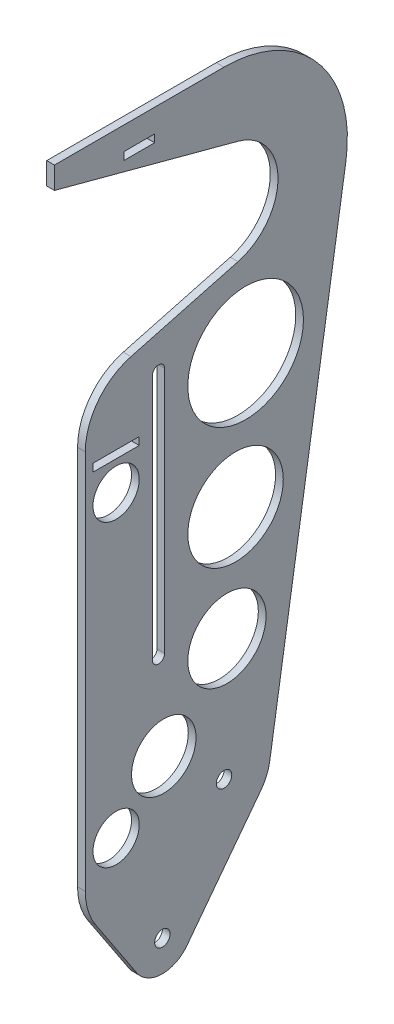
ISO-10303-21;
HEADER;
FILE_DESCRIPTION(('STEP AP214'),'2;1');
FILE_NAME('part.step','',(''),(''),'','','');
FILE_SCHEMA(('AUTOMOTIVE_DESIGN { 1 0 10303 214 1 1 1 1 }'));
ENDSEC;
DATA;
#1=APPLICATION_CONTEXT('core data for automotive mechanical design processes');
#2=APPLICATION_PROTOCOL_DEFINITION('international standard','automotive_design',2000,#1);
#3=PRODUCT_CONTEXT('',#1,'mechanical');
#4=PRODUCT('Part','Part','',(#3));
#5=PRODUCT_RELATED_PRODUCT_CATEGORY('part','',(#4));
#6=PRODUCT_DEFINITION_FORMATION('','',#4);
#7=PRODUCT_DEFINITION_CONTEXT('part definition',#1,'design');
#8=PRODUCT_DEFINITION('design','',#6,#7);
#9=PRODUCT_DEFINITION_SHAPE('','',#8);
#10=(LENGTH_UNIT() NAMED_UNIT(*) SI_UNIT(.MILLI.,.METRE.));
#11=(NAMED_UNIT(*) PLANE_ANGLE_UNIT() SI_UNIT($,.RADIAN.));
#12=(NAMED_UNIT(*) SI_UNIT($,.STERADIAN.) SOLID_ANGLE_UNIT());
#13=UNCERTAINTY_MEASURE_WITH_UNIT(LENGTH_MEASURE(1.E-05),#10,'distance_accuracy_value','');
#14=(GEOMETRIC_REPRESENTATION_CONTEXT(3) GLOBAL_UNCERTAINTY_ASSIGNED_CONTEXT((#13)) GLOBAL_UNIT_ASSIGNED_CONTEXT((#10,
#11,#12)) REPRESENTATION_CONTEXT('',''));
#15=CARTESIAN_POINT('',(0.,0.,0.));
#16=DIRECTION('',(0.,0.,1.));
#17=DIRECTION('',(1.,0.,0.));
#18=AXIS2_PLACEMENT_3D('',#15,#16,#17);
#19=CARTESIAN_POINT('',(3.175,203.2,0.));
#20=DIRECTION('',(-1.,0.,0.));
#21=DIRECTION('',(0.,0.,1.));
#22=AXIS2_PLACEMENT_3D('',#19,#20,#21);
#23=PLANE('',#22);
#24=CARTESIAN_POINT('',(3.175,124.46,44.45));
#25=DIRECTION('',(1.,0.,0.));
#26=DIRECTION('',(0.,0.,-1.));
#27=AXIS2_PLACEMENT_3D('',#24,#25,#26);
#28=CIRCLE('',#27,9.525);
#29=CARTESIAN_POINT('',(3.175,124.46,34.925));
#30=VERTEX_POINT('',#29);
#31=EDGE_CURVE('E855',#30,#30,#28,.T.);
#32=ORIENTED_EDGE('',*,*,#31,.F.);
#33=EDGE_LOOP('',(#32));
#34=FACE_BOUND('',#33,.T.);
#35=CARTESIAN_POINT('',(3.175,1.27,44.45));
#36=DIRECTION('',(1.,0.,0.));
#37=DIRECTION('',(0.,0.,-1.));
#38=AXIS2_PLACEMENT_3D('',#35,#36,#37);
#39=CIRCLE('',#38,9.525);
#40=CARTESIAN_POINT('',(3.175,1.27,34.925));
#41=VERTEX_POINT('',#40);
#42=EDGE_CURVE('E863',#41,#41,#39,.T.);
#43=ORIENTED_EDGE('',*,*,#42,.F.);
#44=EDGE_LOOP('',(#43));
#45=FACE_BOUND('',#44,.T.);
#46=CARTESIAN_POINT('',(3.175,147.612778574097,-8.88808208542456));
#47=DIRECTION('',(1.,0.,0.));
#48=DIRECTION('',(0.,0.,-1.));
#49=AXIS2_PLACEMENT_3D('',#46,#47,#48);
#50=CIRCLE('',#49,23.8105820854246);
#51=CARTESIAN_POINT('',(3.175,147.612778574097,-32.6986641708491));
#52=VERTEX_POINT('',#51);
#53=EDGE_CURVE('E870',#52,#52,#50,.T.);
#54=ORIENTED_EDGE('',*,*,#53,.F.);
#55=EDGE_LOOP('',(#54));
#56=FACE_BOUND('',#55,.T.);
#57=CARTESIAN_POINT('',(3.175,20.6984393575094,24.8267463531368));
#58=DIRECTION('',(1.,0.,0.));
#59=DIRECTION('',(0.,0.,-1.));
#60=AXIS2_PLACEMENT_3D('',#57,#58,#59);
#61=CIRCLE('',#60,13.2732536468632);
#62=CARTESIAN_POINT('',(3.175,20.6984393575094,11.5534927062736));
#63=VERTEX_POINT('',#62);
#64=EDGE_CURVE('E860',#63,#63,#61,.T.);
#65=ORIENTED_EDGE('',*,*,#64,.F.);
#66=EDGE_LOOP('',(#65));
#67=FACE_BOUND('',#66,.T.);
#68=CARTESIAN_POINT('',(3.175,49.6306110729896,-1.18592452574991));
#69=DIRECTION('',(1.,0.,0.));
#70=DIRECTION('',(0.,0.,-1.));
#71=AXIS2_PLACEMENT_3D('',#68,#69,#70);
#72=CIRCLE('',#71,16.1084245257499);
#73=CARTESIAN_POINT('',(3.175,49.6306110729896,-17.2943490514998));
#74=VERTEX_POINT('',#73);
#75=EDGE_CURVE('E254',#74,#74,#72,.T.);
#76=ORIENTED_EDGE('',*,*,#75,.F.);
#77=EDGE_LOOP('',(#76));
#78=FACE_BOUND('',#77,.T.);
#79=CARTESIAN_POINT('',(3.175,94.7824594358713,-4.73520965661337));
#80=DIRECTION('',(1.,0.,0.));
#81=DIRECTION('',(0.,0.,-1.));
#82=AXIS2_PLACEMENT_3D('',#79,#80,#81);
#83=CIRCLE('',#82,19.6577096566134);
#84=CARTESIAN_POINT('',(3.175,94.7824594358713,-24.3929193132267));
#85=VERTEX_POINT('',#84);
#86=EDGE_CURVE('E881',#85,#85,#83,.T.);
#87=ORIENTED_EDGE('',*,*,#86,.F.);
#88=EDGE_LOOP('',(#87));
#89=FACE_BOUND('',#88,.T.);
#90=DIRECTION('',(0.,0.,1.));
#91=VECTOR('',#90,1.);
#92=CARTESIAN_POINT('',(3.175,136.525,53.975));
#93=LINE('',#92,#91);
#94=CARTESIAN_POINT('',(3.175,136.525,34.925));
#95=VERTEX_POINT('',#94);
#96=CARTESIAN_POINT('',(3.175,136.525,53.975));
#97=VERTEX_POINT('',#96);
#98=EDGE_CURVE('E235',#95,#97,#93,.T.);
#99=ORIENTED_EDGE('',*,*,#98,.T.);
#100=DIRECTION('',(0.,1.,0.));
#101=VECTOR('',#100,1.);
#102=CARTESIAN_POINT('',(3.175,139.7,53.975));
#103=LINE('',#102,#101);
#104=CARTESIAN_POINT('',(3.175,139.7,53.975));
#105=VERTEX_POINT('',#104);
#106=EDGE_CURVE('E226',#97,#105,#103,.T.);
#107=ORIENTED_EDGE('',*,*,#106,.T.);
#108=DIRECTION('',(0.,0.,-1.));
#109=VECTOR('',#108,1.);
#110=CARTESIAN_POINT('',(3.175,139.7,53.975));
#111=LINE('',#110,#109);
#112=CARTESIAN_POINT('',(3.175,139.7,34.925));
#113=VERTEX_POINT('',#112);
#114=EDGE_CURVE('E238',#105,#113,#111,.T.);
#115=ORIENTED_EDGE('',*,*,#114,.T.);
#116=DIRECTION('',(0.,-1.,0.));
#117=VECTOR('',#116,1.);
#118=CARTESIAN_POINT('',(3.175,139.7,34.925));
#119=LINE('',#118,#117);
#120=EDGE_CURVE('E55',#113,#95,#119,.T.);
#121=ORIENTED_EDGE('',*,*,#120,.T.);
#122=EDGE_LOOP('',(#99,#107,#115,#121));
#123=FACE_BOUND('',#122,.T.);
#124=DIRECTION('',(0.,0.,1.));
#125=VECTOR('',#124,1.);
#126=CARTESIAN_POINT('',(3.175,241.3,41.275));
#127=LINE('',#126,#125);
#128=CARTESIAN_POINT('',(3.175,241.3,28.575));
#129=VERTEX_POINT('',#128);
#130=CARTESIAN_POINT('',(3.175,241.3,41.275));
#131=VERTEX_POINT('',#130);
#132=EDGE_CURVE('E286',#129,#131,#127,.T.);
#133=ORIENTED_EDGE('',*,*,#132,.T.);
#134=DIRECTION('',(0.,1.,0.));
#135=VECTOR('',#134,1.);
#136=CARTESIAN_POINT('',(3.175,241.3,41.275));
#137=LINE('',#136,#135);
#138=CARTESIAN_POINT('',(3.175,244.475,41.275));
#139=VERTEX_POINT('',#138);
#140=EDGE_CURVE('E278',#131,#139,#137,.T.);
#141=ORIENTED_EDGE('',*,*,#140,.T.);
#142=DIRECTION('',(0.,0.,-1.));
#143=VECTOR('',#142,1.);
#144=CARTESIAN_POINT('',(3.175,244.475,41.275));
#145=LINE('',#144,#143);
#146=CARTESIAN_POINT('',(3.175,244.475,28.575));
#147=VERTEX_POINT('',#146);
#148=EDGE_CURVE('E281',#139,#147,#145,.T.);
#149=ORIENTED_EDGE('',*,*,#148,.T.);
#150=DIRECTION('',(0.,-1.,0.));
#151=VECTOR('',#150,1.);
#152=CARTESIAN_POINT('',(3.175,241.3,28.575));
#153=LINE('',#152,#151);
#154=EDGE_CURVE('E63',#147,#129,#153,.T.);
#155=ORIENTED_EDGE('',*,*,#154,.T.);
#156=EDGE_LOOP('',(#133,#141,#149,#155));
#157=FACE_BOUND('',#156,.T.);
#158=CARTESIAN_POINT('',(3.175,-43.9940905122494,25.4000000000001));
#159=DIRECTION('',(1.,0.,0.));
#160=DIRECTION('',(0.,0.,-1.));
#161=AXIS2_PLACEMENT_3D('',#158,#159,#160);
#162=CIRCLE('',#161,3.175);
#163=CARTESIAN_POINT('',(3.175,-43.9940905122494,22.2250000000001));
#164=VERTEX_POINT('',#163);
#165=EDGE_CURVE('E341',#164,#164,#162,.T.);
#166=ORIENTED_EDGE('',*,*,#165,.F.);
#167=EDGE_LOOP('',(#166));
#168=FACE_BOUND('',#167,.T.);
#169=CARTESIAN_POINT('',(3.175,0.,0.));
#170=DIRECTION('',(1.,0.,0.));
#171=DIRECTION('',(0.,0.,-1.));
#172=AXIS2_PLACEMENT_3D('',#169,#170,#171);
#173=CIRCLE('',#172,3.175);
#174=CARTESIAN_POINT('',(3.175,0.,-3.175));
#175=VERTEX_POINT('',#174);
#176=EDGE_CURVE('E347',#175,#175,#173,.T.);
#177=ORIENTED_EDGE('',*,*,#176,.F.);
#178=EDGE_LOOP('',(#177));
#179=FACE_BOUND('',#178,.T.);
#180=DIRECTION('',(0.,-1.,0.));
#181=VECTOR('',#180,1.);
#182=CARTESIAN_POINT('',(3.175,244.925264200928,69.85));
#183=LINE('',#182,#181);
#184=CARTESIAN_POINT('',(3.175,254.,69.85));
#185=VERTEX_POINT('',#184);
#186=CARTESIAN_POINT('',(3.175,244.925264200928,69.85));
#187=VERTEX_POINT('',#186);
#188=EDGE_CURVE('E353',#185,#187,#183,.T.);
#189=ORIENTED_EDGE('',*,*,#188,.T.);
#190=DIRECTION('',(0.,-0.258819045102514,-0.96592582628907));
#191=VECTOR('',#190,1.);
#192=CARTESIAN_POINT('',(3.175,244.925264200928,69.85));
#193=LINE('',#192,#191);
#194=CARTESIAN_POINT('',(3.175,224.667701489275,-5.75225327740338));
#195=VERTEX_POINT('',#194);
#196=EDGE_CURVE('E356',#187,#195,#193,.T.);
#197=ORIENTED_EDGE('',*,*,#196,.T.);
#198=CARTESIAN_POINT('',(3.175,203.2,0.));
#199=DIRECTION('',(-1.,0.,0.));
#200=DIRECTION('',(0.,0.,1.));
#201=AXIS2_PLACEMENT_3D('',#198,#199,#200);
#202=CIRCLE('',#201,22.225);
#203=CARTESIAN_POINT('',(3.175,181.732298510725,-5.75225327740356));
#204=VERTEX_POINT('',#203);
#205=EDGE_CURVE('E359',#195,#204,#202,.T.);
#206=ORIENTED_EDGE('',*,*,#205,.T.);
#207=DIRECTION('',(0.,-0.258819045102522,0.965925826289068));
#208=VECTOR('',#207,1.);
#209=CARTESIAN_POINT('',(3.175,181.732298510725,-5.75225327740354));
#210=LINE('',#209,#208);
#211=CARTESIAN_POINT('',(3.175,169.922101036024,38.3240037456041));
#212=VERTEX_POINT('',#211);
#213=EDGE_CURVE('E361',#204,#212,#210,.T.);
#214=ORIENTED_EDGE('',*,*,#213,.T.);
#215=CARTESIAN_POINT('',(3.175,145.387585048282,31.75));
#216=DIRECTION('',(1.,0.,0.));
#217=DIRECTION('',(0.,0.,1.));
#218=AXIS2_PLACEMENT_3D('',#215,#216,#217);
#219=CIRCLE('',#218,25.4);
#220=CARTESIAN_POINT('',(3.175,145.387585048282,57.15));
#221=VERTEX_POINT('',#220);
#222=EDGE_CURVE('E364',#212,#221,#219,.T.);
#223=ORIENTED_EDGE('',*,*,#222,.T.);
#224=DIRECTION('',(0.,-1.,0.));
#225=VECTOR('',#224,1.);
#226=CARTESIAN_POINT('',(3.175,-11.4024649442902,57.15));
#227=LINE('',#226,#225);
#228=CARTESIAN_POINT('',(3.175,-11.4024649442902,57.15));
#229=VERTEX_POINT('',#228);
#230=EDGE_CURVE('E367',#221,#229,#227,.T.);
#231=ORIENTED_EDGE('',*,*,#230,.T.);
#232=CARTESIAN_POINT('',(3.175,-11.4024649442902,31.75));
#233=DIRECTION('',(1.,0.,0.));
#234=DIRECTION('',(0.,0.,1.));
#235=AXIS2_PLACEMENT_3D('',#232,#233,#234);
#236=CIRCLE('',#235,25.4);
#237=CARTESIAN_POINT('',(3.175,-25.4262558388826,52.9276601385693));
#238=VERTEX_POINT('',#237);
#239=EDGE_CURVE('E370',#229,#238,#236,.T.);
#240=ORIENTED_EDGE('',*,*,#239,.T.);
#241=DIRECTION('',(0.,-0.833766147187767,-0.552117751755608));
#242=VECTOR('',#241,1.);
#243=CARTESIAN_POINT('',(3.175,-51.0059859595457,35.9888300692847));
#244=LINE('',#243,#242);
#245=CARTESIAN_POINT('',(3.175,-51.0059859595457,35.9888300692847));
#246=VERTEX_POINT('',#245);
#247=EDGE_CURVE('E372',#238,#246,#244,.T.);
#248=ORIENTED_EDGE('',*,*,#247,.T.);
#249=CARTESIAN_POINT('',(3.175,-43.9940905122494,25.4000000000001));
#250=DIRECTION('',(1.,0.,0.));
#251=DIRECTION('',(0.,0.,1.));
#252=AXIS2_PLACEMENT_3D('',#249,#250,#251);
#253=CIRCLE('',#252,12.7);
#254=CARTESIAN_POINT('',(3.175,-51.6691011502298,15.2814916263865));
#255=VERTEX_POINT('',#254);
#256=EDGE_CURVE('E374',#246,#255,#253,.T.);
#257=ORIENTED_EDGE('',*,*,#256,.T.);
#258=DIRECTION('',(0.,0.796732942804219,-0.604331546297666));
#259=VECTOR('',#258,1.);
#260=CARTESIAN_POINT('',(3.175,-51.6691011502298,15.2814916263865));
#261=LINE('',#260,#259);
#262=CARTESIAN_POINT('',(3.175,-11.5125159569705,-15.1777625604204));
#263=VERTEX_POINT('',#262);
#264=EDGE_CURVE('E376',#255,#263,#261,.T.);
#265=ORIENTED_EDGE('',*,*,#264,.T.);
#266=CARTESIAN_POINT('',(3.175,0.,0.));
#267=DIRECTION('',(1.,0.,0.));
#268=DIRECTION('',(0.,0.,-1.));
#269=AXIS2_PLACEMENT_3D('',#266,#267,#268);
#270=CIRCLE('',#269,19.05);
#271=CARTESIAN_POINT('',(3.175,-2.9765625,-18.8160191242354));
#272=VERTEX_POINT('',#271);
#273=EDGE_CURVE('E378',#263,#272,#270,.T.);
#274=ORIENTED_EDGE('',*,*,#273,.T.);
#275=DIRECTION('',(0.,0.987717539329944,-0.15625));
#276=VECTOR('',#275,1.);
#277=CARTESIAN_POINT('',(3.175,-2.9765625,-18.8160191242354));
#278=LINE('',#277,#276);
#279=CARTESIAN_POINT('',(3.175,195.2625,-50.1760509979612));
#280=VERTEX_POINT('',#279);
#281=EDGE_CURVE('E380',#272,#280,#278,.T.);
#282=ORIENTED_EDGE('',*,*,#281,.T.);
#283=CARTESIAN_POINT('',(3.175,203.2,0.));
#284=DIRECTION('',(1.,0.,0.));
#285=DIRECTION('',(0.,0.,1.));
#286=AXIS2_PLACEMENT_3D('',#283,#284,#285);
#287=CIRCLE('',#286,50.8);
#288=CARTESIAN_POINT('',(3.175,254.,0.));
#289=VERTEX_POINT('',#288);
#290=EDGE_CURVE('E382',#280,#289,#287,.T.);
#291=ORIENTED_EDGE('',*,*,#290,.T.);
#292=DIRECTION('',(0.,0.,1.));
#293=VECTOR('',#292,1.);
#294=CARTESIAN_POINT('',(3.175,254.,69.85));
#295=LINE('',#294,#293);
#296=EDGE_CURVE('E384',#289,#185,#295,.T.);
#297=ORIENTED_EDGE('',*,*,#296,.T.);
#298=EDGE_LOOP('',(#189,#197,#206,#214,#223,#231,#240,#248,#257,#265,#274,#282,#291,#297));
#299=FACE_BOUND('',#298,.T.);
#300=CARTESIAN_POINT('',(3.175,158.75,26.9875));
#301=DIRECTION('',(1.,0.,0.));
#302=DIRECTION('',(0.,0.,-1.));
#303=AXIS2_PLACEMENT_3D('',#300,#301,#302);
#304=CIRCLE('',#303,2.54);
#305=CARTESIAN_POINT('',(3.175,158.75,24.4475));
#306=VERTEX_POINT('',#305);
#307=CARTESIAN_POINT('',(3.175,158.75,29.5275));
#308=VERTEX_POINT('',#307);
#309=EDGE_CURVE('E308',#306,#308,#304,.T.);
#310=ORIENTED_EDGE('',*,*,#309,.F.);
#311=DIRECTION('',(0.,1.,0.));
#312=VECTOR('',#311,1.);
#313=CARTESIAN_POINT('',(3.175,158.75,24.4475));
#314=LINE('',#313,#312);
#315=CARTESIAN_POINT('',(3.175,57.15,24.4475));
#316=VERTEX_POINT('',#315);
#317=EDGE_CURVE('E317',#316,#306,#314,.T.);
#318=ORIENTED_EDGE('',*,*,#317,.F.);
#319=CARTESIAN_POINT('',(3.175,57.15,26.9875));
#320=DIRECTION('',(1.,0.,0.));
#321=DIRECTION('',(0.,0.,-1.));
#322=AXIS2_PLACEMENT_3D('',#319,#320,#321);
#323=CIRCLE('',#322,2.54);
#324=CARTESIAN_POINT('',(3.175,57.15,29.5275));
#325=VERTEX_POINT('',#324);
#326=EDGE_CURVE('E314',#325,#316,#323,.T.);
#327=ORIENTED_EDGE('',*,*,#326,.F.);
#328=DIRECTION('',(0.,-1.,0.));
#329=VECTOR('',#328,1.);
#330=CARTESIAN_POINT('',(3.175,158.75,29.5275));
#331=LINE('',#330,#329);
#332=EDGE_CURVE('E310',#308,#325,#331,.T.);
#333=ORIENTED_EDGE('',*,*,#332,.F.);
#334=EDGE_LOOP('',(#310,#318,#327,#333));
#335=FACE_BOUND('',#334,.T.);
#336=ADVANCED_FACE('F37',(#34,#45,#56,#67,#78,#89,#123,#157,#168,#179,#299,#335),#23,.F.);
#337=CARTESIAN_POINT('',(0.,203.2,0.));
#338=DIRECTION('',(-1.,0.,0.));
#339=DIRECTION('',(0.,0.,1.));
#340=AXIS2_PLACEMENT_3D('',#337,#338,#339);
#341=PLANE('',#340);
#342=CARTESIAN_POINT('',(0.,124.46,44.45));
#343=DIRECTION('',(1.,0.,0.));
#344=DIRECTION('',(0.,0.,-1.));
#345=AXIS2_PLACEMENT_3D('',#342,#343,#344);
#346=CIRCLE('',#345,9.525);
#347=CARTESIAN_POINT('',(0.,124.46,34.925));
#348=VERTEX_POINT('',#347);
#349=EDGE_CURVE('E853',#348,#348,#346,.T.);
#350=ORIENTED_EDGE('',*,*,#349,.T.);
#351=EDGE_LOOP('',(#350));
#352=FACE_BOUND('',#351,.T.);
#353=CARTESIAN_POINT('',(0.,1.27,44.45));
#354=DIRECTION('',(1.,0.,0.));
#355=DIRECTION('',(0.,0.,-1.));
#356=AXIS2_PLACEMENT_3D('',#353,#354,#355);
#357=CIRCLE('',#356,9.525);
#358=CARTESIAN_POINT('',(0.,1.27,34.925));
#359=VERTEX_POINT('',#358);
#360=EDGE_CURVE('E857',#359,#359,#357,.T.);
#361=ORIENTED_EDGE('',*,*,#360,.T.);
#362=EDGE_LOOP('',(#361));
#363=FACE_BOUND('',#362,.T.);
#364=CARTESIAN_POINT('',(0.,147.612778574097,-8.88808208542456));
#365=DIRECTION('',(1.,0.,0.));
#366=DIRECTION('',(0.,0.,-1.));
#367=AXIS2_PLACEMENT_3D('',#364,#365,#366);
#368=CIRCLE('',#367,23.8105820854246);
#369=CARTESIAN_POINT('',(0.,147.612778574097,-32.6986641708491));
#370=VERTEX_POINT('',#369);
#371=EDGE_CURVE('E293',#370,#370,#368,.T.);
#372=ORIENTED_EDGE('',*,*,#371,.T.);
#373=EDGE_LOOP('',(#372));
#374=FACE_BOUND('',#373,.T.);
#375=CARTESIAN_POINT('',(0.,20.6984393575094,24.8267463531368));
#376=DIRECTION('',(1.,0.,0.));
#377=DIRECTION('',(0.,0.,-1.));
#378=AXIS2_PLACEMENT_3D('',#375,#376,#377);
#379=CIRCLE('',#378,13.2732536468632);
#380=CARTESIAN_POINT('',(0.,20.6984393575094,11.5534927062736));
#381=VERTEX_POINT('',#380);
#382=EDGE_CURVE('E874',#381,#381,#379,.T.);
#383=ORIENTED_EDGE('',*,*,#382,.T.);
#384=EDGE_LOOP('',(#383));
#385=FACE_BOUND('',#384,.T.);
#386=CARTESIAN_POINT('',(0.,49.6306110729896,-1.18592452574991));
#387=DIRECTION('',(1.,0.,0.));
#388=DIRECTION('',(0.,0.,-1.));
#389=AXIS2_PLACEMENT_3D('',#386,#387,#388);
#390=CIRCLE('',#389,16.1084245257499);
#391=CARTESIAN_POINT('',(0.,49.6306110729896,-17.2943490514998));
#392=VERTEX_POINT('',#391);
#393=EDGE_CURVE('E883',#392,#392,#390,.T.);
#394=ORIENTED_EDGE('',*,*,#393,.T.);
#395=EDGE_LOOP('',(#394));
#396=FACE_BOUND('',#395,.T.);
#397=CARTESIAN_POINT('',(0.,94.7824594358713,-4.73520965661337));
#398=DIRECTION('',(1.,0.,0.));
#399=DIRECTION('',(0.,0.,-1.));
#400=AXIS2_PLACEMENT_3D('',#397,#398,#399);
#401=CIRCLE('',#400,19.6577096566134);
#402=CARTESIAN_POINT('',(0.,94.7824594358713,-24.3929193132267));
#403=VERTEX_POINT('',#402);
#404=EDGE_CURVE('E873',#403,#403,#401,.T.);
#405=ORIENTED_EDGE('',*,*,#404,.T.);
#406=EDGE_LOOP('',(#405));
#407=FACE_BOUND('',#406,.T.);
#408=DIRECTION('',(0.,1.,0.));
#409=VECTOR('',#408,1.);
#410=CARTESIAN_POINT('',(0.,139.7,53.975));
#411=LINE('',#410,#409);
#412=CARTESIAN_POINT('',(0.,136.525,53.975));
#413=VERTEX_POINT('',#412);
#414=CARTESIAN_POINT('',(0.,139.7,53.975));
#415=VERTEX_POINT('',#414);
#416=EDGE_CURVE('E229',#413,#415,#411,.T.);
#417=ORIENTED_EDGE('',*,*,#416,.F.);
#418=DIRECTION('',(0.,0.,1.));
#419=VECTOR('',#418,1.);
#420=CARTESIAN_POINT('',(0.,136.525,53.975));
#421=LINE('',#420,#419);
#422=CARTESIAN_POINT('',(0.,136.525,34.925));
#423=VERTEX_POINT('',#422);
#424=EDGE_CURVE('E246',#423,#413,#421,.T.);
#425=ORIENTED_EDGE('',*,*,#424,.F.);
#426=DIRECTION('',(0.,-1.,0.));
#427=VECTOR('',#426,1.);
#428=CARTESIAN_POINT('',(0.,139.7,34.925));
#429=LINE('',#428,#427);
#430=CARTESIAN_POINT('',(0.,139.7,34.925));
#431=VERTEX_POINT('',#430);
#432=EDGE_CURVE('E251',#431,#423,#429,.T.);
#433=ORIENTED_EDGE('',*,*,#432,.F.);
#434=DIRECTION('',(0.,0.,-1.));
#435=VECTOR('',#434,1.);
#436=CARTESIAN_POINT('',(0.,139.7,53.975));
#437=LINE('',#436,#435);
#438=EDGE_CURVE('E262',#415,#431,#437,.T.);
#439=ORIENTED_EDGE('',*,*,#438,.F.);
#440=EDGE_LOOP('',(#417,#425,#433,#439));
#441=FACE_BOUND('',#440,.T.);
#442=DIRECTION('',(0.,1.,0.));
#443=VECTOR('',#442,1.);
#444=CARTESIAN_POINT('',(0.,241.3,41.275));
#445=LINE('',#444,#443);
#446=CARTESIAN_POINT('',(0.,241.3,41.275));
#447=VERTEX_POINT('',#446);
#448=CARTESIAN_POINT('',(0.,244.475,41.275));
#449=VERTEX_POINT('',#448);
#450=EDGE_CURVE('E290',#447,#449,#445,.T.);
#451=ORIENTED_EDGE('',*,*,#450,.F.);
#452=DIRECTION('',(0.,0.,1.));
#453=VECTOR('',#452,1.);
#454=CARTESIAN_POINT('',(0.,241.3,41.275));
#455=LINE('',#454,#453);
#456=CARTESIAN_POINT('',(0.,241.3,28.575));
#457=VERTEX_POINT('',#456);
#458=EDGE_CURVE('E282',#457,#447,#455,.T.);
#459=ORIENTED_EDGE('',*,*,#458,.F.);
#460=DIRECTION('',(0.,-1.,0.));
#461=VECTOR('',#460,1.);
#462=CARTESIAN_POINT('',(0.,241.3,28.575));
#463=LINE('',#462,#461);
#464=CARTESIAN_POINT('',(0.,244.475,28.575));
#465=VERTEX_POINT('',#464);
#466=EDGE_CURVE('E296',#465,#457,#463,.T.);
#467=ORIENTED_EDGE('',*,*,#466,.F.);
#468=DIRECTION('',(0.,0.,-1.));
#469=VECTOR('',#468,1.);
#470=CARTESIAN_POINT('',(0.,244.475,41.275));
#471=LINE('',#470,#469);
#472=EDGE_CURVE('E292',#449,#465,#471,.T.);
#473=ORIENTED_EDGE('',*,*,#472,.F.);
#474=EDGE_LOOP('',(#451,#459,#467,#473));
#475=FACE_BOUND('',#474,.T.);
#476=CARTESIAN_POINT('',(0.,0.,0.));
#477=DIRECTION('',(1.,0.,0.));
#478=DIRECTION('',(0.,0.,-1.));
#479=AXIS2_PLACEMENT_3D('',#476,#477,#478);
#480=CIRCLE('',#479,3.175);
#481=CARTESIAN_POINT('',(0.,0.,-3.175));
#482=VERTEX_POINT('',#481);
#483=EDGE_CURVE('E344',#482,#482,#480,.T.);
#484=ORIENTED_EDGE('',*,*,#483,.T.);
#485=EDGE_LOOP('',(#484));
#486=FACE_BOUND('',#485,.T.);
#487=DIRECTION('',(0.,-1.,0.));
#488=VECTOR('',#487,1.);
#489=CARTESIAN_POINT('',(0.,244.925264200928,69.85));
#490=LINE('',#489,#488);
#491=CARTESIAN_POINT('',(0.,254.,69.85));
#492=VERTEX_POINT('',#491);
#493=CARTESIAN_POINT('',(0.,244.925264200928,69.85));
#494=VERTEX_POINT('',#493);
#495=EDGE_CURVE('E350',#492,#494,#490,.T.);
#496=ORIENTED_EDGE('',*,*,#495,.F.);
#497=DIRECTION('',(0.,0.,1.));
#498=VECTOR('',#497,1.);
#499=CARTESIAN_POINT('',(0.,254.,69.85));
#500=LINE('',#499,#498);
#501=CARTESIAN_POINT('',(0.,254.,0.));
#502=VERTEX_POINT('',#501);
#503=EDGE_CURVE('E357',#502,#492,#500,.T.);
#504=ORIENTED_EDGE('',*,*,#503,.F.);
#505=CARTESIAN_POINT('',(0.,203.2,0.));
#506=DIRECTION('',(1.,0.,0.));
#507=DIRECTION('',(0.,0.,1.));
#508=AXIS2_PLACEMENT_3D('',#505,#506,#507);
#509=CIRCLE('',#508,50.8);
#510=CARTESIAN_POINT('',(0.,195.2625,-50.1760509979612));
#511=VERTEX_POINT('',#510);
#512=EDGE_CURVE('E414',#511,#502,#509,.T.);
#513=ORIENTED_EDGE('',*,*,#512,.F.);
#514=DIRECTION('',(0.,0.987717539329944,-0.15625));
#515=VECTOR('',#514,1.);
#516=CARTESIAN_POINT('',(0.,-2.9765625,-18.8160191242354));
#517=LINE('',#516,#515);
#518=CARTESIAN_POINT('',(0.,-2.9765625,-18.8160191242354));
#519=VERTEX_POINT('',#518);
#520=EDGE_CURVE('E412',#519,#511,#517,.T.);
#521=ORIENTED_EDGE('',*,*,#520,.F.);
#522=CARTESIAN_POINT('',(0.,0.,0.));
#523=DIRECTION('',(1.,0.,0.));
#524=DIRECTION('',(0.,0.,-1.));
#525=AXIS2_PLACEMENT_3D('',#522,#523,#524);
#526=CIRCLE('',#525,19.05);
#527=CARTESIAN_POINT('',(0.,-11.5125159569705,-15.1777625604204));
#528=VERTEX_POINT('',#527);
#529=EDGE_CURVE('E410',#528,#519,#526,.T.);
#530=ORIENTED_EDGE('',*,*,#529,.F.);
#531=DIRECTION('',(0.,0.796732942804219,-0.604331546297666));
#532=VECTOR('',#531,1.);
#533=CARTESIAN_POINT('',(0.,-51.6691011502298,15.2814916263865));
#534=LINE('',#533,#532);
#535=CARTESIAN_POINT('',(0.,-51.6691011502298,15.2814916263865));
#536=VERTEX_POINT('',#535);
#537=EDGE_CURVE('E408',#536,#528,#534,.T.);
#538=ORIENTED_EDGE('',*,*,#537,.F.);
#539=CARTESIAN_POINT('',(0.,-43.9940905122494,25.4000000000001));
#540=DIRECTION('',(1.,0.,0.));
#541=DIRECTION('',(0.,0.,1.));
#542=AXIS2_PLACEMENT_3D('',#539,#540,#541);
#543=CIRCLE('',#542,12.7);
#544=CARTESIAN_POINT('',(0.,-51.0059859595457,35.9888300692847));
#545=VERTEX_POINT('',#544);
#546=EDGE_CURVE('E406',#545,#536,#543,.T.);
#547=ORIENTED_EDGE('',*,*,#546,.F.);
#548=DIRECTION('',(0.,-0.833766147187767,-0.552117751755608));
#549=VECTOR('',#548,1.);
#550=CARTESIAN_POINT('',(0.,-51.0059859595457,35.9888300692847));
#551=LINE('',#550,#549);
#552=CARTESIAN_POINT('',(0.,-25.4262558388826,52.9276601385693));
#553=VERTEX_POINT('',#552);
#554=EDGE_CURVE('E404',#553,#545,#551,.T.);
#555=ORIENTED_EDGE('',*,*,#554,.F.);
#556=CARTESIAN_POINT('',(0.,-11.4024649442902,31.75));
#557=DIRECTION('',(1.,0.,0.));
#558=DIRECTION('',(0.,0.,1.));
#559=AXIS2_PLACEMENT_3D('',#556,#557,#558);
#560=CIRCLE('',#559,25.4);
#561=CARTESIAN_POINT('',(0.,-11.4024649442902,57.15));
#562=VERTEX_POINT('',#561);
#563=EDGE_CURVE('E402',#562,#553,#560,.T.);
#564=ORIENTED_EDGE('',*,*,#563,.F.);
#565=DIRECTION('',(0.,-1.,0.));
#566=VECTOR('',#565,1.);
#567=CARTESIAN_POINT('',(0.,-11.4024649442902,57.15));
#568=LINE('',#567,#566);
#569=CARTESIAN_POINT('',(0.,145.387585048282,57.15));
#570=VERTEX_POINT('',#569);
#571=EDGE_CURVE('E399',#570,#562,#568,.T.);
#572=ORIENTED_EDGE('',*,*,#571,.F.);
#573=CARTESIAN_POINT('',(0.,145.387585048282,31.75));
#574=DIRECTION('',(1.,0.,0.));
#575=DIRECTION('',(0.,0.,1.));
#576=AXIS2_PLACEMENT_3D('',#573,#574,#575);
#577=CIRCLE('',#576,25.4);
#578=CARTESIAN_POINT('',(0.,169.922101036024,38.3240037456041));
#579=VERTEX_POINT('',#578);
#580=EDGE_CURVE('E396',#579,#570,#577,.T.);
#581=ORIENTED_EDGE('',*,*,#580,.F.);
#582=DIRECTION('',(0.,-0.258819045102522,0.965925826289068));
#583=VECTOR('',#582,1.);
#584=CARTESIAN_POINT('',(0.,181.732298510725,-5.75225327740354));
#585=LINE('',#584,#583);
#586=CARTESIAN_POINT('',(0.,181.732298510725,-5.75225327740356));
#587=VERTEX_POINT('',#586);
#588=EDGE_CURVE('E393',#587,#579,#585,.T.);
#589=ORIENTED_EDGE('',*,*,#588,.F.);
#590=CARTESIAN_POINT('',(0.,203.2,0.));
#591=DIRECTION('',(-1.,0.,0.));
#592=DIRECTION('',(0.,0.,1.));
#593=AXIS2_PLACEMENT_3D('',#590,#591,#592);
#594=CIRCLE('',#593,22.225);
#595=CARTESIAN_POINT('',(0.,224.667701489275,-5.75225327740338));
#596=VERTEX_POINT('',#595);
#597=EDGE_CURVE('E391',#596,#587,#594,.T.);
#598=ORIENTED_EDGE('',*,*,#597,.F.);
#599=DIRECTION('',(0.,-0.258819045102514,-0.96592582628907));
#600=VECTOR('',#599,1.);
#601=CARTESIAN_POINT('',(0.,244.925264200928,69.85));
#602=LINE('',#601,#600);
#603=EDGE_CURVE('E389',#494,#596,#602,.T.);
#604=ORIENTED_EDGE('',*,*,#603,.F.);
#605=EDGE_LOOP('',(#496,#504,#513,#521,#530,#538,#547,#555,#564,#572,#581,#589,#598,#604));
#606=FACE_BOUND('',#605,.T.);
#607=CARTESIAN_POINT('',(0.,-43.9940905122494,25.4000000000001));
#608=DIRECTION('',(1.,0.,0.));
#609=DIRECTION('',(0.,0.,-1.));
#610=AXIS2_PLACEMENT_3D('',#607,#608,#609);
#611=CIRCLE('',#610,3.175);
#612=CARTESIAN_POINT('',(0.,-43.9940905122494,22.2250000000001));
#613=VERTEX_POINT('',#612);
#614=EDGE_CURVE('E340',#613,#613,#611,.T.);
#615=ORIENTED_EDGE('',*,*,#614,.T.);
#616=EDGE_LOOP('',(#615));
#617=FACE_BOUND('',#616,.T.);
#618=DIRECTION('',(0.,1.,0.));
#619=VECTOR('',#618,1.);
#620=CARTESIAN_POINT('',(0.,158.75,24.4475));
#621=LINE('',#620,#619);
#622=CARTESIAN_POINT('',(0.,57.15,24.4475));
#623=VERTEX_POINT('',#622);
#624=CARTESIAN_POINT('',(0.,158.75,24.4475));
#625=VERTEX_POINT('',#624);
#626=EDGE_CURVE('E311',#623,#625,#621,.T.);
#627=ORIENTED_EDGE('',*,*,#626,.T.);
#628=CARTESIAN_POINT('',(0.,158.75,26.9875));
#629=DIRECTION('',(1.,0.,0.));
#630=DIRECTION('',(0.,0.,-1.));
#631=AXIS2_PLACEMENT_3D('',#628,#629,#630);
#632=CIRCLE('',#631,2.54);
#633=CARTESIAN_POINT('',(0.,158.75,29.5275));
#634=VERTEX_POINT('',#633);
#635=EDGE_CURVE('E272',#625,#634,#632,.T.);
#636=ORIENTED_EDGE('',*,*,#635,.T.);
#637=DIRECTION('',(0.,-1.,0.));
#638=VECTOR('',#637,1.);
#639=CARTESIAN_POINT('',(0.,158.75,29.5275));
#640=LINE('',#639,#638);
#641=CARTESIAN_POINT('',(0.,57.15,29.5275));
#642=VERTEX_POINT('',#641);
#643=EDGE_CURVE('E322',#634,#642,#640,.T.);
#644=ORIENTED_EDGE('',*,*,#643,.T.);
#645=CARTESIAN_POINT('',(0.,57.15,26.9875));
#646=DIRECTION('',(1.,0.,0.));
#647=DIRECTION('',(0.,0.,-1.));
#648=AXIS2_PLACEMENT_3D('',#645,#646,#647);
#649=CIRCLE('',#648,2.54);
#650=EDGE_CURVE('E326',#642,#623,#649,.T.);
#651=ORIENTED_EDGE('',*,*,#650,.T.);
#652=EDGE_LOOP('',(#627,#636,#644,#651));
#653=FACE_BOUND('',#652,.T.);
#654=ADVANCED_FACE('F464',(#352,#363,#374,#385,#396,#407,#441,#475,#486,#606,#617,#653),#341,.T.);
#655=CARTESIAN_POINT('',(3.175,244.925264200928,69.85));
#656=DIRECTION('',(0.,0.,-1.));
#657=DIRECTION('',(-1.,0.,0.));
#658=AXIS2_PLACEMENT_3D('',#655,#656,#657);
#659=PLANE('',#658);
#660=ORIENTED_EDGE('',*,*,#495,.T.);
#661=DIRECTION('',(-1.,0.,0.));
#662=VECTOR('',#661,1.);
#663=CARTESIAN_POINT('',(3.175,244.925264200928,69.85));
#664=LINE('',#663,#662);
#665=EDGE_CURVE('E11',#187,#494,#664,.T.);
#666=ORIENTED_EDGE('',*,*,#665,.F.);
#667=ORIENTED_EDGE('',*,*,#188,.F.);
#668=DIRECTION('',(-1.,0.,0.));
#669=VECTOR('',#668,1.);
#670=CARTESIAN_POINT('',(3.175,254.,69.85));
#671=LINE('',#670,#669);
#672=EDGE_CURVE('E386',#185,#492,#671,.T.);
#673=ORIENTED_EDGE('',*,*,#672,.T.);
#674=EDGE_LOOP('',(#660,#666,#667,#673));
#675=FACE_BOUND('',#674,.T.);
#676=ADVANCED_FACE('F39',(#675),#659,.F.);
#677=CARTESIAN_POINT('',(3.175,244.925264200928,69.85));
#678=DIRECTION('',(0.,0.96592582628907,-0.258819045102514));
#679=DIRECTION('',(0.,0.258819045102514,0.96592582628907));
#680=AXIS2_PLACEMENT_3D('',#677,#678,#679);
#681=PLANE('',#680);
#682=ORIENTED_EDGE('',*,*,#603,.T.);
#683=DIRECTION('',(-1.,0.,0.));
#684=VECTOR('',#683,1.);
#685=CARTESIAN_POINT('',(3.175,224.667701489275,-5.75225327740338));
#686=LINE('',#685,#684);
#687=EDGE_CURVE('E45',#195,#596,#686,.T.);
#688=ORIENTED_EDGE('',*,*,#687,.F.);
#689=ORIENTED_EDGE('',*,*,#196,.F.);
#690=ORIENTED_EDGE('',*,*,#665,.T.);
#691=EDGE_LOOP('',(#682,#688,#689,#690));
#692=FACE_BOUND('',#691,.T.);
#693=ADVANCED_FACE('F482',(#692),#681,.F.);
#694=CARTESIAN_POINT('',(3.175,203.2,0.));
#695=DIRECTION('',(-1.,0.,0.));
#696=DIRECTION('',(0.,0.,1.));
#697=AXIS2_PLACEMENT_3D('',#694,#695,#696);
#698=CYLINDRICAL_SURFACE('',#697,22.225);
#699=ORIENTED_EDGE('',*,*,#597,.T.);
#700=DIRECTION('',(-1.,0.,0.));
#701=VECTOR('',#700,1.);
#702=CARTESIAN_POINT('',(3.175,181.732298510725,-5.75225327740356));
#703=LINE('',#702,#701);
#704=EDGE_CURVE('E451',#204,#587,#703,.T.);
#705=ORIENTED_EDGE('',*,*,#704,.F.);
#706=ORIENTED_EDGE('',*,*,#205,.F.);
#707=ORIENTED_EDGE('',*,*,#687,.T.);
#708=EDGE_LOOP('',(#699,#705,#706,#707));
#709=FACE_BOUND('',#708,.T.);
#710=ADVANCED_FACE('F458',(#709),#698,.F.);
#711=CARTESIAN_POINT('',(3.175,181.732298510725,-5.75225327740354));
#712=DIRECTION('',(0.,-0.965925826289068,-0.258819045102522));
#713=DIRECTION('',(0.,0.258819045102522,-0.965925826289068));
#714=AXIS2_PLACEMENT_3D('',#711,#712,#713);
#715=PLANE('',#714);
#716=ORIENTED_EDGE('',*,*,#588,.T.);
#717=DIRECTION('',(-1.,0.,0.));
#718=VECTOR('',#717,1.);
#719=CARTESIAN_POINT('',(3.175,169.922101036024,38.3240037456041));
#720=LINE('',#719,#718);
#721=EDGE_CURVE('E447',#212,#579,#720,.T.);
#722=ORIENTED_EDGE('',*,*,#721,.F.);
#723=ORIENTED_EDGE('',*,*,#213,.F.);
#724=ORIENTED_EDGE('',*,*,#704,.T.);
#725=EDGE_LOOP('',(#716,#722,#723,#724));
#726=FACE_BOUND('',#725,.T.);
#727=ADVANCED_FACE('F470',(#726),#715,.F.);
#728=CARTESIAN_POINT('',(3.175,145.387585048282,31.75));
#729=DIRECTION('',(-1.,0.,0.));
#730=DIRECTION('',(0.,0.,1.));
#731=AXIS2_PLACEMENT_3D('',#728,#729,#730);
#732=CYLINDRICAL_SURFACE('',#731,25.4);
#733=ORIENTED_EDGE('',*,*,#580,.T.);
#734=DIRECTION('',(-1.,0.,0.));
#735=VECTOR('',#734,1.);
#736=CARTESIAN_POINT('',(3.175,145.387585048282,57.15));
#737=LINE('',#736,#735);
#738=EDGE_CURVE('E443',#221,#570,#737,.T.);
#739=ORIENTED_EDGE('',*,*,#738,.F.);
#740=ORIENTED_EDGE('',*,*,#222,.F.);
#741=ORIENTED_EDGE('',*,*,#721,.T.);
#742=EDGE_LOOP('',(#733,#739,#740,#741));
#743=FACE_BOUND('',#742,.T.);
#744=ADVANCED_FACE('F474',(#743),#732,.T.);
#745=CARTESIAN_POINT('',(3.175,-11.4024649442902,57.15));
#746=DIRECTION('',(0.,0.,-1.));
#747=DIRECTION('',(0.,1.,0.));
#748=AXIS2_PLACEMENT_3D('',#745,#746,#747);
#749=PLANE('',#748);
#750=ORIENTED_EDGE('',*,*,#571,.T.);
#751=DIRECTION('',(-1.,0.,0.));
#752=VECTOR('',#751,1.);
#753=CARTESIAN_POINT('',(3.175,-11.4024649442902,57.15));
#754=LINE('',#753,#752);
#755=EDGE_CURVE('E440',#229,#562,#754,.T.);
#756=ORIENTED_EDGE('',*,*,#755,.F.);
#757=ORIENTED_EDGE('',*,*,#230,.F.);
#758=ORIENTED_EDGE('',*,*,#738,.T.);
#759=EDGE_LOOP('',(#750,#756,#757,#758));
#760=FACE_BOUND('',#759,.T.);
#761=ADVANCED_FACE('F525',(#760),#749,.F.);
#762=CARTESIAN_POINT('',(3.175,-11.4024649442902,31.75));
#763=DIRECTION('',(-1.,0.,0.));
#764=DIRECTION('',(0.,0.,1.));
#765=AXIS2_PLACEMENT_3D('',#762,#763,#764);
#766=CYLINDRICAL_SURFACE('',#765,25.4);
#767=ORIENTED_EDGE('',*,*,#563,.T.);
#768=DIRECTION('',(-1.,0.,0.));
#769=VECTOR('',#768,1.);
#770=CARTESIAN_POINT('',(3.175,-25.4262558388826,52.9276601385693));
#771=LINE('',#770,#769);
#772=EDGE_CURVE('E437',#238,#553,#771,.T.);
#773=ORIENTED_EDGE('',*,*,#772,.F.);
#774=ORIENTED_EDGE('',*,*,#239,.F.);
#775=ORIENTED_EDGE('',*,*,#755,.T.);
#776=EDGE_LOOP('',(#767,#773,#774,#775));
#777=FACE_BOUND('',#776,.T.);
#778=ADVANCED_FACE('F523',(#777),#766,.T.);
#779=CARTESIAN_POINT('',(3.175,-51.0059859595457,35.9888300692847));
#780=DIRECTION('',(0.,0.552117751755608,-0.833766147187767));
#781=DIRECTION('',(0.,0.833766147187767,0.552117751755608));
#782=AXIS2_PLACEMENT_3D('',#779,#780,#781);
#783=PLANE('',#782);
#784=ORIENTED_EDGE('',*,*,#554,.T.);
#785=DIRECTION('',(-1.,0.,0.));
#786=VECTOR('',#785,1.);
#787=CARTESIAN_POINT('',(3.175,-51.0059859595457,35.9888300692847));
#788=LINE('',#787,#786);
#789=EDGE_CURVE('E434',#246,#545,#788,.T.);
#790=ORIENTED_EDGE('',*,*,#789,.F.);
#791=ORIENTED_EDGE('',*,*,#247,.F.);
#792=ORIENTED_EDGE('',*,*,#772,.T.);
#793=EDGE_LOOP('',(#784,#790,#791,#792));
#794=FACE_BOUND('',#793,.T.);
#795=ADVANCED_FACE('F518',(#794),#783,.F.);
#796=CARTESIAN_POINT('',(3.175,-43.9940905122494,25.4000000000001));
#797=DIRECTION('',(-1.,0.,0.));
#798=DIRECTION('',(0.,0.,1.));
#799=AXIS2_PLACEMENT_3D('',#796,#797,#798);
#800=CYLINDRICAL_SURFACE('',#799,12.7);
#801=ORIENTED_EDGE('',*,*,#546,.T.);
#802=DIRECTION('',(-1.,0.,0.));
#803=VECTOR('',#802,1.);
#804=CARTESIAN_POINT('',(3.175,-51.6691011502298,15.2814916263865));
#805=LINE('',#804,#803);
#806=EDGE_CURVE('E431',#255,#536,#805,.T.);
#807=ORIENTED_EDGE('',*,*,#806,.F.);
#808=ORIENTED_EDGE('',*,*,#256,.F.);
#809=ORIENTED_EDGE('',*,*,#789,.T.);
#810=EDGE_LOOP('',(#801,#807,#808,#809));
#811=FACE_BOUND('',#810,.T.);
#812=ADVANCED_FACE('F513',(#811),#800,.T.);
#813=CARTESIAN_POINT('',(3.175,-51.6691011502298,15.2814916263865));
#814=DIRECTION('',(0.,0.604331546297666,0.796732942804219));
#815=DIRECTION('',(0.,-0.796732942804219,0.604331546297666));
#816=AXIS2_PLACEMENT_3D('',#813,#814,#815);
#817=PLANE('',#816);
#818=ORIENTED_EDGE('',*,*,#537,.T.);
#819=DIRECTION('',(-1.,0.,0.));
#820=VECTOR('',#819,1.);
#821=CARTESIAN_POINT('',(3.175,-11.5125159569705,-15.1777625604204));
#822=LINE('',#821,#820);
#823=EDGE_CURVE('E428',#263,#528,#822,.T.);
#824=ORIENTED_EDGE('',*,*,#823,.F.);
#825=ORIENTED_EDGE('',*,*,#264,.F.);
#826=ORIENTED_EDGE('',*,*,#806,.T.);
#827=EDGE_LOOP('',(#818,#824,#825,#826));
#828=FACE_BOUND('',#827,.T.);
#829=ADVANCED_FACE('F509',(#828),#817,.F.);
#830=CARTESIAN_POINT('',(3.175,0.,0.));
#831=DIRECTION('',(-1.,0.,0.));
#832=DIRECTION('',(0.,0.,1.));
#833=AXIS2_PLACEMENT_3D('',#830,#831,#832);
#834=CYLINDRICAL_SURFACE('',#833,19.05);
#835=ORIENTED_EDGE('',*,*,#529,.T.);
#836=DIRECTION('',(-1.,0.,0.));
#837=VECTOR('',#836,1.);
#838=CARTESIAN_POINT('',(3.175,-2.9765625,-18.8160191242354));
#839=LINE('',#838,#837);
#840=EDGE_CURVE('E425',#272,#519,#839,.T.);
#841=ORIENTED_EDGE('',*,*,#840,.F.);
#842=ORIENTED_EDGE('',*,*,#273,.F.);
#843=ORIENTED_EDGE('',*,*,#823,.T.);
#844=EDGE_LOOP('',(#835,#841,#842,#843));
#845=FACE_BOUND('',#844,.T.);
#846=ADVANCED_FACE('F504',(#845),#834,.T.);
#847=CARTESIAN_POINT('',(3.175,-2.9765625,-18.8160191242354));
#848=DIRECTION('',(0.,0.15625,0.987717539329944));
#849=DIRECTION('',(0.,-0.987717539329944,0.15625));
#850=AXIS2_PLACEMENT_3D('',#847,#848,#849);
#851=PLANE('',#850);
#852=ORIENTED_EDGE('',*,*,#520,.T.);
#853=DIRECTION('',(-1.,0.,0.));
#854=VECTOR('',#853,1.);
#855=CARTESIAN_POINT('',(3.175,195.2625,-50.1760509979612));
#856=LINE('',#855,#854);
#857=EDGE_CURVE('E422',#280,#511,#856,.T.);
#858=ORIENTED_EDGE('',*,*,#857,.F.);
#859=ORIENTED_EDGE('',*,*,#281,.F.);
#860=ORIENTED_EDGE('',*,*,#840,.T.);
#861=EDGE_LOOP('',(#852,#858,#859,#860));
#862=FACE_BOUND('',#861,.T.);
#863=ADVANCED_FACE('F498',(#862),#851,.F.);
#864=CARTESIAN_POINT('',(3.175,203.2,0.));
#865=DIRECTION('',(-1.,0.,0.));
#866=DIRECTION('',(0.,0.,1.));
#867=AXIS2_PLACEMENT_3D('',#864,#865,#866);
#868=CYLINDRICAL_SURFACE('',#867,50.8);
#869=ORIENTED_EDGE('',*,*,#512,.T.);
#870=DIRECTION('',(-1.,0.,0.));
#871=VECTOR('',#870,1.);
#872=CARTESIAN_POINT('',(3.175,254.,0.));
#873=LINE('',#872,#871);
#874=EDGE_CURVE('E419',#289,#502,#873,.T.);
#875=ORIENTED_EDGE('',*,*,#874,.F.);
#876=ORIENTED_EDGE('',*,*,#290,.F.);
#877=ORIENTED_EDGE('',*,*,#857,.T.);
#878=EDGE_LOOP('',(#869,#875,#876,#877));
#879=FACE_BOUND('',#878,.T.);
#880=ADVANCED_FACE('F494',(#879),#868,.T.);
#881=CARTESIAN_POINT('',(3.175,254.,69.85));
#882=DIRECTION('',(0.,-1.,0.));
#883=DIRECTION('',(0.,0.,-1.));
#884=AXIS2_PLACEMENT_3D('',#881,#882,#883);
#885=PLANE('',#884);
#886=ORIENTED_EDGE('',*,*,#503,.T.);
#887=ORIENTED_EDGE('',*,*,#672,.F.);
#888=ORIENTED_EDGE('',*,*,#296,.F.);
#889=ORIENTED_EDGE('',*,*,#874,.T.);
#890=EDGE_LOOP('',(#886,#887,#888,#889));
#891=FACE_BOUND('',#890,.T.);
#892=ADVANCED_FACE('F489',(#891),#885,.F.);
#893=CARTESIAN_POINT('',(3.175,0.,0.));
#894=DIRECTION('',(-1.,0.,0.));
#895=DIRECTION('',(0.,0.,1.));
#896=AXIS2_PLACEMENT_3D('',#893,#894,#895);
#897=CYLINDRICAL_SURFACE('',#896,3.175);
#898=ORIENTED_EDGE('',*,*,#176,.T.);
#899=EDGE_LOOP('',(#898));
#900=FACE_BOUND('',#899,.T.);
#901=ORIENTED_EDGE('',*,*,#483,.F.);
#902=EDGE_LOOP('',(#901));
#903=FACE_BOUND('',#902,.T.);
#904=ADVANCED_FACE('F545',(#900,#903),#897,.F.);
#905=CARTESIAN_POINT('',(3.175,-43.9940905122494,25.4000000000001));
#906=DIRECTION('',(-1.,0.,0.));
#907=DIRECTION('',(0.,0.,1.));
#908=AXIS2_PLACEMENT_3D('',#905,#906,#907);
#909=CYLINDRICAL_SURFACE('',#908,3.175);
#910=ORIENTED_EDGE('',*,*,#165,.T.);
#911=EDGE_LOOP('',(#910));
#912=FACE_BOUND('',#911,.T.);
#913=ORIENTED_EDGE('',*,*,#614,.F.);
#914=EDGE_LOOP('',(#913));
#915=FACE_BOUND('',#914,.T.);
#916=ADVANCED_FACE('F595',(#912,#915),#909,.F.);
#917=CARTESIAN_POINT('',(3.175,158.75,26.9875));
#918=DIRECTION('',(-1.,0.,0.));
#919=DIRECTION('',(0.,0.,1.));
#920=AXIS2_PLACEMENT_3D('',#917,#918,#919);
#921=CYLINDRICAL_SURFACE('',#920,2.54);
#922=ORIENTED_EDGE('',*,*,#635,.F.);
#923=DIRECTION('',(-1.,0.,0.));
#924=VECTOR('',#923,1.);
#925=CARTESIAN_POINT('',(3.175,158.75,24.4475));
#926=LINE('',#925,#924);
#927=EDGE_CURVE('E319',#306,#625,#926,.T.);
#928=ORIENTED_EDGE('',*,*,#927,.F.);
#929=ORIENTED_EDGE('',*,*,#309,.T.);
#930=DIRECTION('',(-1.,0.,0.));
#931=VECTOR('',#930,1.);
#932=CARTESIAN_POINT('',(3.175,158.75,29.5275));
#933=LINE('',#932,#931);
#934=EDGE_CURVE('E337',#308,#634,#933,.T.);
#935=ORIENTED_EDGE('',*,*,#934,.T.);
#936=EDGE_LOOP('',(#922,#928,#929,#935));
#937=FACE_BOUND('',#936,.T.);
#938=ADVANCED_FACE('F602',(#937),#921,.F.);
#939=CARTESIAN_POINT('',(3.175,158.75,29.5275));
#940=DIRECTION('',(0.,0.,-1.));
#941=DIRECTION('',(0.,1.,0.));
#942=AXIS2_PLACEMENT_3D('',#939,#940,#941);
#943=PLANE('',#942);
#944=ORIENTED_EDGE('',*,*,#643,.F.);
#945=ORIENTED_EDGE('',*,*,#934,.F.);
#946=ORIENTED_EDGE('',*,*,#332,.T.);
#947=DIRECTION('',(-1.,0.,0.));
#948=VECTOR('',#947,1.);
#949=CARTESIAN_POINT('',(3.175,57.15,29.5275));
#950=LINE('',#949,#948);
#951=EDGE_CURVE('E335',#325,#642,#950,.T.);
#952=ORIENTED_EDGE('',*,*,#951,.T.);
#953=EDGE_LOOP('',(#944,#945,#946,#952));
#954=FACE_BOUND('',#953,.T.);
#955=ADVANCED_FACE('F609',(#954),#943,.T.);
#956=CARTESIAN_POINT('',(3.175,57.15,26.9875));
#957=DIRECTION('',(-1.,0.,0.));
#958=DIRECTION('',(0.,0.,1.));
#959=AXIS2_PLACEMENT_3D('',#956,#957,#958);
#960=CYLINDRICAL_SURFACE('',#959,2.54);
#961=ORIENTED_EDGE('',*,*,#650,.F.);
#962=ORIENTED_EDGE('',*,*,#951,.F.);
#963=ORIENTED_EDGE('',*,*,#326,.T.);
#964=DIRECTION('',(-1.,0.,0.));
#965=VECTOR('',#964,1.);
#966=CARTESIAN_POINT('',(3.175,57.15,24.4475));
#967=LINE('',#966,#965);
#968=EDGE_CURVE('E333',#316,#623,#967,.T.);
#969=ORIENTED_EDGE('',*,*,#968,.T.);
#970=EDGE_LOOP('',(#961,#962,#963,#969));
#971=FACE_BOUND('',#970,.T.);
#972=ADVANCED_FACE('F617',(#971),#960,.F.);
#973=CARTESIAN_POINT('',(3.175,158.75,24.4475));
#974=DIRECTION('',(0.,0.,1.));
#975=DIRECTION('',(0.,-1.,0.));
#976=AXIS2_PLACEMENT_3D('',#973,#974,#975);
#977=PLANE('',#976);
#978=ORIENTED_EDGE('',*,*,#626,.F.);
#979=ORIENTED_EDGE('',*,*,#968,.F.);
#980=ORIENTED_EDGE('',*,*,#317,.T.);
#981=ORIENTED_EDGE('',*,*,#927,.T.);
#982=EDGE_LOOP('',(#978,#979,#980,#981));
#983=FACE_BOUND('',#982,.T.);
#984=ADVANCED_FACE('F625',(#983),#977,.T.);
#985=CARTESIAN_POINT('',(3.175,241.3,41.275));
#986=DIRECTION('',(0.,0.,1.));
#987=DIRECTION('',(1.,0.,0.));
#988=AXIS2_PLACEMENT_3D('',#985,#986,#987);
#989=PLANE('',#988);
#990=ORIENTED_EDGE('',*,*,#450,.T.);
#991=DIRECTION('',(-1.,0.,0.));
#992=VECTOR('',#991,1.);
#993=CARTESIAN_POINT('',(3.175,244.475,41.275));
#994=LINE('',#993,#992);
#995=EDGE_CURVE('E289',#139,#449,#994,.T.);
#996=ORIENTED_EDGE('',*,*,#995,.F.);
#997=ORIENTED_EDGE('',*,*,#140,.F.);
#998=DIRECTION('',(-1.,0.,0.));
#999=VECTOR('',#998,1.);
#1000=CARTESIAN_POINT('',(3.175,241.3,41.275));
#1001=LINE('',#1000,#999);
#1002=EDGE_CURVE('E263',#131,#447,#1001,.T.);
#1003=ORIENTED_EDGE('',*,*,#1002,.T.);
#1004=EDGE_LOOP('',(#990,#996,#997,#1003));
#1005=FACE_BOUND('',#1004,.T.);
#1006=ADVANCED_FACE('F633',(#1005),#989,.F.);
#1007=CARTESIAN_POINT('',(3.175,241.3,41.275));
#1008=DIRECTION('',(0.,-1.,0.));
#1009=DIRECTION('',(0.,0.,-1.));
#1010=AXIS2_PLACEMENT_3D('',#1007,#1008,#1009);
#1011=PLANE('',#1010);
#1012=ORIENTED_EDGE('',*,*,#458,.T.);
#1013=ORIENTED_EDGE('',*,*,#1002,.F.);
#1014=ORIENTED_EDGE('',*,*,#132,.F.);
#1015=DIRECTION('',(-1.,0.,0.));
#1016=VECTOR('',#1015,1.);
#1017=CARTESIAN_POINT('',(3.175,241.3,28.575));
#1018=LINE('',#1017,#1016);
#1019=EDGE_CURVE('E302',#129,#457,#1018,.T.);
#1020=ORIENTED_EDGE('',*,*,#1019,.T.);
#1021=EDGE_LOOP('',(#1012,#1013,#1014,#1020));
#1022=FACE_BOUND('',#1021,.T.);
#1023=ADVANCED_FACE('F641',(#1022),#1011,.F.);
#1024=CARTESIAN_POINT('',(3.175,241.3,28.575));
#1025=DIRECTION('',(0.,0.,-1.));
#1026=DIRECTION('',(-1.,0.,0.));
#1027=AXIS2_PLACEMENT_3D('',#1024,#1025,#1026);
#1028=PLANE('',#1027);
#1029=ORIENTED_EDGE('',*,*,#466,.T.);
#1030=ORIENTED_EDGE('',*,*,#1019,.F.);
#1031=ORIENTED_EDGE('',*,*,#154,.F.);
#1032=DIRECTION('',(-1.,0.,0.));
#1033=VECTOR('',#1032,1.);
#1034=CARTESIAN_POINT('',(3.175,244.475,28.575));
#1035=LINE('',#1034,#1033);
#1036=EDGE_CURVE('E304',#147,#465,#1035,.T.);
#1037=ORIENTED_EDGE('',*,*,#1036,.T.);
#1038=EDGE_LOOP('',(#1029,#1030,#1031,#1037));
#1039=FACE_BOUND('',#1038,.T.);
#1040=ADVANCED_FACE('F649',(#1039),#1028,.F.);
#1041=CARTESIAN_POINT('',(3.175,244.475,41.275));
#1042=DIRECTION('',(0.,1.,0.));
#1043=DIRECTION('',(0.,0.,1.));
#1044=AXIS2_PLACEMENT_3D('',#1041,#1042,#1043);
#1045=PLANE('',#1044);
#1046=ORIENTED_EDGE('',*,*,#472,.T.);
#1047=ORIENTED_EDGE('',*,*,#1036,.F.);
#1048=ORIENTED_EDGE('',*,*,#148,.F.);
#1049=ORIENTED_EDGE('',*,*,#995,.T.);
#1050=EDGE_LOOP('',(#1046,#1047,#1048,#1049));
#1051=FACE_BOUND('',#1050,.T.);
#1052=ADVANCED_FACE('F657',(#1051),#1045,.F.);
#1053=CARTESIAN_POINT('',(3.175,139.7,53.975));
#1054=DIRECTION('',(0.,0.,1.));
#1055=DIRECTION('',(1.,0.,0.));
#1056=AXIS2_PLACEMENT_3D('',#1053,#1054,#1055);
#1057=PLANE('',#1056);
#1058=ORIENTED_EDGE('',*,*,#416,.T.);
#1059=DIRECTION('',(-1.,0.,0.));
#1060=VECTOR('',#1059,1.);
#1061=CARTESIAN_POINT('',(3.175,139.7,53.975));
#1062=LINE('',#1061,#1060);
#1063=EDGE_CURVE('E222',#105,#415,#1062,.T.);
#1064=ORIENTED_EDGE('',*,*,#1063,.F.);
#1065=ORIENTED_EDGE('',*,*,#106,.F.);
#1066=DIRECTION('',(-1.,0.,0.));
#1067=VECTOR('',#1066,1.);
#1068=CARTESIAN_POINT('',(3.175,136.525,53.975));
#1069=LINE('',#1068,#1067);
#1070=EDGE_CURVE('E269',#97,#413,#1069,.T.);
#1071=ORIENTED_EDGE('',*,*,#1070,.T.);
#1072=EDGE_LOOP('',(#1058,#1064,#1065,#1071));
#1073=FACE_BOUND('',#1072,.T.);
#1074=ADVANCED_FACE('F224',(#1073),#1057,.F.);
#1075=CARTESIAN_POINT('',(3.175,136.525,53.975));
#1076=DIRECTION('',(0.,-1.,0.));
#1077=DIRECTION('',(0.,0.,-1.));
#1078=AXIS2_PLACEMENT_3D('',#1075,#1076,#1077);
#1079=PLANE('',#1078);
#1080=ORIENTED_EDGE('',*,*,#424,.T.);
#1081=ORIENTED_EDGE('',*,*,#1070,.F.);
#1082=ORIENTED_EDGE('',*,*,#98,.F.);
#1083=DIRECTION('',(-1.,0.,0.));
#1084=VECTOR('',#1083,1.);
#1085=CARTESIAN_POINT('',(3.175,136.525,34.925));
#1086=LINE('',#1085,#1084);
#1087=EDGE_CURVE('E273',#95,#423,#1086,.T.);
#1088=ORIENTED_EDGE('',*,*,#1087,.T.);
#1089=EDGE_LOOP('',(#1080,#1081,#1082,#1088));
#1090=FACE_BOUND('',#1089,.T.);
#1091=ADVANCED_FACE('F671',(#1090),#1079,.F.);
#1092=CARTESIAN_POINT('',(3.175,139.7,34.925));
#1093=DIRECTION('',(0.,0.,-1.));
#1094=DIRECTION('',(-1.,0.,0.));
#1095=AXIS2_PLACEMENT_3D('',#1092,#1093,#1094);
#1096=PLANE('',#1095);
#1097=ORIENTED_EDGE('',*,*,#432,.T.);
#1098=ORIENTED_EDGE('',*,*,#1087,.F.);
#1099=ORIENTED_EDGE('',*,*,#120,.F.);
#1100=DIRECTION('',(-1.,0.,0.));
#1101=VECTOR('',#1100,1.);
#1102=CARTESIAN_POINT('',(3.175,139.7,34.925));
#1103=LINE('',#1102,#1101);
#1104=EDGE_CURVE('E234',#113,#431,#1103,.T.);
#1105=ORIENTED_EDGE('',*,*,#1104,.T.);
#1106=EDGE_LOOP('',(#1097,#1098,#1099,#1105));
#1107=FACE_BOUND('',#1106,.T.);
#1108=ADVANCED_FACE('F678',(#1107),#1096,.F.);
#1109=CARTESIAN_POINT('',(3.175,139.7,53.975));
#1110=DIRECTION('',(0.,1.,0.));
#1111=DIRECTION('',(0.,0.,1.));
#1112=AXIS2_PLACEMENT_3D('',#1109,#1110,#1111);
#1113=PLANE('',#1112);
#1114=ORIENTED_EDGE('',*,*,#438,.T.);
#1115=ORIENTED_EDGE('',*,*,#1104,.F.);
#1116=ORIENTED_EDGE('',*,*,#114,.F.);
#1117=ORIENTED_EDGE('',*,*,#1063,.T.);
#1118=EDGE_LOOP('',(#1114,#1115,#1116,#1117));
#1119=FACE_BOUND('',#1118,.T.);
#1120=ADVANCED_FACE('F239',(#1119),#1113,.F.);
#1121=CARTESIAN_POINT('',(0.,94.7824594358713,-4.73520965661337));
#1122=DIRECTION('',(1.,0.,0.));
#1123=DIRECTION('',(0.,0.,-1.));
#1124=AXIS2_PLACEMENT_3D('',#1121,#1122,#1123);
#1125=CYLINDRICAL_SURFACE('',#1124,19.6577096566134);
#1126=ORIENTED_EDGE('',*,*,#404,.F.);
#1127=EDGE_LOOP('',(#1126));
#1128=FACE_BOUND('',#1127,.T.);
#1129=ORIENTED_EDGE('',*,*,#86,.T.);
#1130=EDGE_LOOP('',(#1129));
#1131=FACE_BOUND('',#1130,.T.);
#1132=ADVANCED_FACE('F692',(#1128,#1131),#1125,.F.);
#1133=CARTESIAN_POINT('',(0.,49.6306110729896,-1.18592452574991));
#1134=DIRECTION('',(1.,0.,0.));
#1135=DIRECTION('',(0.,0.,-1.));
#1136=AXIS2_PLACEMENT_3D('',#1133,#1134,#1135);
#1137=CYLINDRICAL_SURFACE('',#1136,16.1084245257499);
#1138=ORIENTED_EDGE('',*,*,#393,.F.);
#1139=EDGE_LOOP('',(#1138));
#1140=FACE_BOUND('',#1139,.T.);
#1141=ORIENTED_EDGE('',*,*,#75,.T.);
#1142=EDGE_LOOP('',(#1141));
#1143=FACE_BOUND('',#1142,.T.);
#1144=ADVANCED_FACE('F699',(#1140,#1143),#1137,.F.);
#1145=CARTESIAN_POINT('',(0.,20.6984393575094,24.8267463531368));
#1146=DIRECTION('',(1.,0.,0.));
#1147=DIRECTION('',(0.,0.,-1.));
#1148=AXIS2_PLACEMENT_3D('',#1145,#1146,#1147);
#1149=CYLINDRICAL_SURFACE('',#1148,13.2732536468632);
#1150=ORIENTED_EDGE('',*,*,#382,.F.);
#1151=EDGE_LOOP('',(#1150));
#1152=FACE_BOUND('',#1151,.T.);
#1153=ORIENTED_EDGE('',*,*,#64,.T.);
#1154=EDGE_LOOP('',(#1153));
#1155=FACE_BOUND('',#1154,.T.);
#1156=ADVANCED_FACE('F707',(#1152,#1155),#1149,.F.);
#1157=CARTESIAN_POINT('',(0.,147.612778574097,-8.88808208542456));
#1158=DIRECTION('',(1.,0.,0.));
#1159=DIRECTION('',(0.,0.,-1.));
#1160=AXIS2_PLACEMENT_3D('',#1157,#1158,#1159);
#1161=CYLINDRICAL_SURFACE('',#1160,23.8105820854246);
#1162=ORIENTED_EDGE('',*,*,#371,.F.);
#1163=EDGE_LOOP('',(#1162));
#1164=FACE_BOUND('',#1163,.T.);
#1165=ORIENTED_EDGE('',*,*,#53,.T.);
#1166=EDGE_LOOP('',(#1165));
#1167=FACE_BOUND('',#1166,.T.);
#1168=ADVANCED_FACE('F715',(#1164,#1167),#1161,.F.);
#1169=CARTESIAN_POINT('',(0.,1.27,44.45));
#1170=DIRECTION('',(1.,0.,0.));
#1171=DIRECTION('',(0.,0.,-1.));
#1172=AXIS2_PLACEMENT_3D('',#1169,#1170,#1171);
#1173=CYLINDRICAL_SURFACE('',#1172,9.525);
#1174=ORIENTED_EDGE('',*,*,#360,.F.);
#1175=EDGE_LOOP('',(#1174));
#1176=FACE_BOUND('',#1175,.T.);
#1177=ORIENTED_EDGE('',*,*,#42,.T.);
#1178=EDGE_LOOP('',(#1177));
#1179=FACE_BOUND('',#1178,.T.);
#1180=ADVANCED_FACE('F723',(#1176,#1179),#1173,.F.);
#1181=CARTESIAN_POINT('',(0.,124.46,44.45));
#1182=DIRECTION('',(1.,0.,0.));
#1183=DIRECTION('',(0.,0.,-1.));
#1184=AXIS2_PLACEMENT_3D('',#1181,#1182,#1183);
#1185=CYLINDRICAL_SURFACE('',#1184,9.525);
#1186=ORIENTED_EDGE('',*,*,#349,.F.);
#1187=EDGE_LOOP('',(#1186));
#1188=FACE_BOUND('',#1187,.T.);
#1189=ORIENTED_EDGE('',*,*,#31,.T.);
#1190=EDGE_LOOP('',(#1189));
#1191=FACE_BOUND('',#1190,.T.);
#1192=ADVANCED_FACE('F731',(#1188,#1191),#1185,.F.);
#1193=CLOSED_SHELL('',(#336,#654,#676,#693,#710,#727,#744,#761,#778,#795,#812,#829,#846,#863,
#880,#892,#904,#916,#938,#955,#972,#984,#1006,#1023,#1040,#1052,#1074,#1091,#1108,#1120,#1132,
#1144,#1156,#1168,#1180,#1192));
#1194=MANIFOLD_SOLID_BREP('B2',#1193);
#1195=ADVANCED_BREP_SHAPE_REPRESENTATION('',(#18,#1194),#14);
#1196=SHAPE_DEFINITION_REPRESENTATION(#9,#1195);
ENDSEC;
END-ISO-10303-21;
